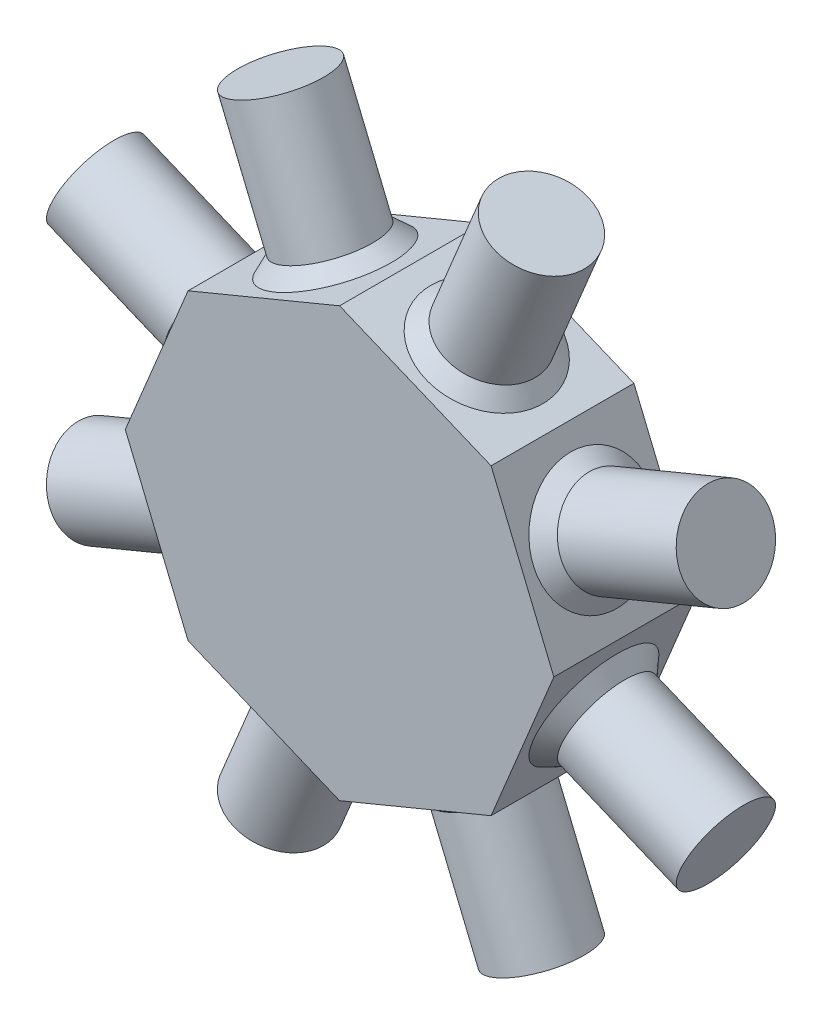
ISO-10303-21;
HEADER;
FILE_DESCRIPTION(('STEP AP214'),'2;1');
FILE_NAME('part.step','',(''),(''),'','','');
FILE_SCHEMA(('AUTOMOTIVE_DESIGN { 1 0 10303 214 1 1 1 1 }'));
ENDSEC;
DATA;
#1=APPLICATION_CONTEXT('core data for automotive mechanical design processes');
#2=APPLICATION_PROTOCOL_DEFINITION('international standard','automotive_design',2000,#1);
#3=PRODUCT_CONTEXT('',#1,'mechanical');
#4=PRODUCT('Part','Part','',(#3));
#5=PRODUCT_RELATED_PRODUCT_CATEGORY('part','',(#4));
#6=PRODUCT_DEFINITION_FORMATION('','',#4);
#7=PRODUCT_DEFINITION_CONTEXT('part definition',#1,'design');
#8=PRODUCT_DEFINITION('design','',#6,#7);
#9=PRODUCT_DEFINITION_SHAPE('','',#8);
#10=(LENGTH_UNIT() NAMED_UNIT(*) SI_UNIT(.MILLI.,.METRE.));
#11=(NAMED_UNIT(*) PLANE_ANGLE_UNIT() SI_UNIT($,.RADIAN.));
#12=(NAMED_UNIT(*) SI_UNIT($,.STERADIAN.) SOLID_ANGLE_UNIT());
#13=UNCERTAINTY_MEASURE_WITH_UNIT(LENGTH_MEASURE(1.E-05),#10,'distance_accuracy_value','');
#14=(GEOMETRIC_REPRESENTATION_CONTEXT(3) GLOBAL_UNCERTAINTY_ASSIGNED_CONTEXT((#13)) GLOBAL_UNIT_ASSIGNED_CONTEXT((#10,
#11,#12)) REPRESENTATION_CONTEXT('',''));
#15=CARTESIAN_POINT('',(0.,0.,0.));
#16=DIRECTION('',(0.,0.,1.));
#17=DIRECTION('',(1.,0.,0.));
#18=AXIS2_PLACEMENT_3D('',#15,#16,#17);
#19=CARTESIAN_POINT('',(0.,38.1,-12.7));
#20=DIRECTION('',(-0.382683432365089,0.923879532511287,0.));
#21=DIRECTION('',(-0.923879532511287,-0.382683432365089,0.));
#22=AXIS2_PLACEMENT_3D('',#19,#20,#21);
#23=PLANE('',#22);
#24=CARTESIAN_POINT('',(-13.4703841816033,32.5203841816039,0.));
#25=DIRECTION('',(-0.382683432365089,0.923879532511287,0.));
#26=DIRECTION('',(-0.923879532511287,-0.382683432365089,0.));
#27=AXIS2_PLACEMENT_3D('',#24,#25,#26);
#28=CIRCLE('',#27,10.795);
#29=CARTESIAN_POINT('',(-23.4436637350626,28.3893165292228,0.));
#30=VERTEX_POINT('',#29);
#31=EDGE_CURVE('E207',#30,#30,#28,.F.);
#32=ORIENTED_EDGE('',*,*,#31,.T.);
#33=EDGE_LOOP('',(#32));
#34=FACE_BOUND('',#33,.T.);
#35=DIRECTION('',(-0.923879532511287,-0.382683432365089,0.));
#36=VECTOR('',#35,1.);
#37=CARTESIAN_POINT('',(0.,38.1,12.7));
#38=LINE('',#37,#36);
#39=CARTESIAN_POINT('',(0.,38.1,12.7));
#40=VERTEX_POINT('',#39);
#41=CARTESIAN_POINT('',(-26.9407683632075,26.9407683632075,12.7));
#42=VERTEX_POINT('',#41);
#43=EDGE_CURVE('E139',#40,#42,#38,.T.);
#44=ORIENTED_EDGE('',*,*,#43,.F.);
#45=DIRECTION('',(0.,0.,1.));
#46=VECTOR('',#45,1.);
#47=CARTESIAN_POINT('',(0.,38.1,-12.7));
#48=LINE('',#47,#46);
#49=CARTESIAN_POINT('',(0.,38.1,-12.7));
#50=VERTEX_POINT('',#49);
#51=EDGE_CURVE('E135',#50,#40,#48,.T.);
#52=ORIENTED_EDGE('',*,*,#51,.F.);
#53=DIRECTION('',(-0.923879532511287,-0.382683432365089,0.));
#54=VECTOR('',#53,1.);
#55=CARTESIAN_POINT('',(0.,38.1,-12.7));
#56=LINE('',#55,#54);
#57=CARTESIAN_POINT('',(-26.9407683632075,26.9407683632075,-12.7));
#58=VERTEX_POINT('',#57);
#59=EDGE_CURVE('E116',#50,#58,#56,.T.);
#60=ORIENTED_EDGE('',*,*,#59,.T.);
#61=DIRECTION('',(0.,0.,1.));
#62=VECTOR('',#61,1.);
#63=CARTESIAN_POINT('',(-26.9407683632075,26.9407683632075,-12.7));
#64=LINE('',#63,#62);
#65=EDGE_CURVE('E108',#58,#42,#64,.T.);
#66=ORIENTED_EDGE('',*,*,#65,.T.);
#67=EDGE_LOOP('',(#44,#52,#60,#66));
#68=FACE_BOUND('',#67,.T.);
#69=ADVANCED_FACE('F34',(#34,#68),#23,.T.);
#70=CARTESIAN_POINT('',(-26.9407683632075,26.9407683632075,-12.7));
#71=DIRECTION('',(-0.923879532511287,0.38268343236509,0.));
#72=DIRECTION('',(-0.38268343236509,-0.923879532511287,0.));
#73=AXIS2_PLACEMENT_3D('',#70,#71,#72);
#74=PLANE('',#73);
#75=CARTESIAN_POINT('',(-32.5203841816036,13.4703841816041,0.));
#76=DIRECTION('',(-0.923879532511287,0.38268343236509,0.));
#77=DIRECTION('',(-0.38268343236509,-0.923879532511287,0.));
#78=AXIS2_PLACEMENT_3D('',#75,#76,#77);
#79=CIRCLE('',#78,10.7950000000001);
#80=CARTESIAN_POINT('',(-36.6514518339848,3.49710462814462,0.));
#81=VERTEX_POINT('',#80);
#82=EDGE_CURVE('E201',#81,#81,#79,.F.);
#83=ORIENTED_EDGE('',*,*,#82,.T.);
#84=EDGE_LOOP('',(#83));
#85=FACE_BOUND('',#84,.T.);
#86=DIRECTION('',(-0.38268343236509,-0.923879532511287,0.));
#87=VECTOR('',#86,1.);
#88=CARTESIAN_POINT('',(-26.9407683632075,26.9407683632075,12.7));
#89=LINE('',#88,#87);
#90=CARTESIAN_POINT('',(-38.1,0.,12.7));
#91=VERTEX_POINT('',#90);
#92=EDGE_CURVE('E49',#42,#91,#89,.T.);
#93=ORIENTED_EDGE('',*,*,#92,.F.);
#94=ORIENTED_EDGE('',*,*,#65,.F.);
#95=DIRECTION('',(-0.38268343236509,-0.923879532511287,0.));
#96=VECTOR('',#95,1.);
#97=CARTESIAN_POINT('',(-26.9407683632075,26.9407683632075,-12.7));
#98=LINE('',#97,#96);
#99=CARTESIAN_POINT('',(-38.1,0.,-12.7));
#100=VERTEX_POINT('',#99);
#101=EDGE_CURVE('E111',#58,#100,#98,.T.);
#102=ORIENTED_EDGE('',*,*,#101,.T.);
#103=DIRECTION('',(0.,0.,1.));
#104=VECTOR('',#103,1.);
#105=CARTESIAN_POINT('',(-38.1,0.,-12.7));
#106=LINE('',#105,#104);
#107=EDGE_CURVE('E99',#100,#91,#106,.T.);
#108=ORIENTED_EDGE('',*,*,#107,.T.);
#109=EDGE_LOOP('',(#93,#94,#102,#108));
#110=FACE_BOUND('',#109,.T.);
#111=ADVANCED_FACE('F112',(#85,#110),#74,.T.);
#112=CARTESIAN_POINT('',(-38.1,0.,-12.7));
#113=DIRECTION('',(-0.923879532511287,-0.382683432365089,0.));
#114=DIRECTION('',(0.38268343236509,-0.923879532511287,0.));
#115=AXIS2_PLACEMENT_3D('',#112,#113,#114);
#116=PLANE('',#115);
#117=CARTESIAN_POINT('',(-32.5203841816039,-13.4703841816034,0.));
#118=DIRECTION('',(-0.923879532511287,-0.382683432365089,0.));
#119=DIRECTION('',(0.38268343236509,-0.923879532511287,0.));
#120=AXIS2_PLACEMENT_3D('',#117,#118,#119);
#121=CIRCLE('',#120,10.7950000000001);
#122=CARTESIAN_POINT('',(-28.3893165292227,-23.4436637350628,0.));
#123=VERTEX_POINT('',#122);
#124=EDGE_CURVE('E195',#123,#123,#121,.F.);
#125=ORIENTED_EDGE('',*,*,#124,.T.);
#126=EDGE_LOOP('',(#125));
#127=FACE_BOUND('',#126,.T.);
#128=DIRECTION('',(0.38268343236509,-0.923879532511287,0.));
#129=VECTOR('',#128,1.);
#130=CARTESIAN_POINT('',(-38.1,0.,12.7));
#131=LINE('',#130,#129);
#132=CARTESIAN_POINT('',(-26.9407683632075,-26.9407683632074,12.7));
#133=VERTEX_POINT('',#132);
#134=EDGE_CURVE('E106',#91,#133,#131,.T.);
#135=ORIENTED_EDGE('',*,*,#134,.F.);
#136=ORIENTED_EDGE('',*,*,#107,.F.);
#137=DIRECTION('',(0.38268343236509,-0.923879532511287,0.));
#138=VECTOR('',#137,1.);
#139=CARTESIAN_POINT('',(-38.1,0.,-12.7));
#140=LINE('',#139,#138);
#141=CARTESIAN_POINT('',(-26.9407683632075,-26.9407683632074,-12.7));
#142=VERTEX_POINT('',#141);
#143=EDGE_CURVE('E103',#100,#142,#140,.T.);
#144=ORIENTED_EDGE('',*,*,#143,.T.);
#145=DIRECTION('',(0.,0.,1.));
#146=VECTOR('',#145,1.);
#147=CARTESIAN_POINT('',(-26.9407683632075,-26.9407683632074,-12.7));
#148=LINE('',#147,#146);
#149=EDGE_CURVE('E107',#142,#133,#148,.T.);
#150=ORIENTED_EDGE('',*,*,#149,.T.);
#151=EDGE_LOOP('',(#135,#136,#144,#150));
#152=FACE_BOUND('',#151,.T.);
#153=ADVANCED_FACE('F101',(#127,#152),#116,.T.);
#154=CARTESIAN_POINT('',(-26.9407683632075,-26.9407683632074,-12.7));
#155=DIRECTION('',(-0.38268343236509,-0.923879532511287,0.));
#156=DIRECTION('',(0.923879532511287,-0.38268343236509,0.));
#157=AXIS2_PLACEMENT_3D('',#154,#155,#156);
#158=PLANE('',#157);
#159=CARTESIAN_POINT('',(-13.4703841816037,-32.5203841816037,0.));
#160=DIRECTION('',(-0.38268343236509,-0.923879532511287,0.));
#161=DIRECTION('',(0.923879532511287,-0.38268343236509,0.));
#162=AXIS2_PLACEMENT_3D('',#159,#160,#161);
#163=CIRCLE('',#162,10.7950000000001);
#164=CARTESIAN_POINT('',(-3.49710462814426,-36.6514518339849,0.));
#165=VERTEX_POINT('',#164);
#166=EDGE_CURVE('E189',#165,#165,#163,.F.);
#167=ORIENTED_EDGE('',*,*,#166,.T.);
#168=EDGE_LOOP('',(#167));
#169=FACE_BOUND('',#168,.T.);
#170=DIRECTION('',(0.923879532511287,-0.38268343236509,0.));
#171=VECTOR('',#170,1.);
#172=CARTESIAN_POINT('',(-26.9407683632075,-26.9407683632074,12.7));
#173=LINE('',#172,#171);
#174=CARTESIAN_POINT('',(0.,-38.1,12.7));
#175=VERTEX_POINT('',#174);
#176=EDGE_CURVE('E145',#133,#175,#173,.T.);
#177=ORIENTED_EDGE('',*,*,#176,.F.);
#178=ORIENTED_EDGE('',*,*,#149,.F.);
#179=DIRECTION('',(0.923879532511287,-0.38268343236509,0.));
#180=VECTOR('',#179,1.);
#181=CARTESIAN_POINT('',(-26.9407683632075,-26.9407683632074,-12.7));
#182=LINE('',#181,#180);
#183=CARTESIAN_POINT('',(0.,-38.1,-12.7));
#184=VERTEX_POINT('',#183);
#185=EDGE_CURVE('E121',#142,#184,#182,.T.);
#186=ORIENTED_EDGE('',*,*,#185,.T.);
#187=DIRECTION('',(0.,0.,1.));
#188=VECTOR('',#187,1.);
#189=CARTESIAN_POINT('',(0.,-38.1,-12.7));
#190=LINE('',#189,#188);
#191=EDGE_CURVE('E164',#184,#175,#190,.T.);
#192=ORIENTED_EDGE('',*,*,#191,.T.);
#193=EDGE_LOOP('',(#177,#178,#186,#192));
#194=FACE_BOUND('',#193,.T.);
#195=ADVANCED_FACE('F321',(#169,#194),#158,.T.);
#196=CARTESIAN_POINT('',(0.,-38.1,-12.7));
#197=DIRECTION('',(0.38268343236509,-0.923879532511287,0.));
#198=DIRECTION('',(0.923879532511287,0.38268343236509,0.));
#199=AXIS2_PLACEMENT_3D('',#196,#197,#198);
#200=PLANE('',#199);
#201=CARTESIAN_POINT('',(13.4703841816035,-32.5203841816038,0.));
#202=DIRECTION('',(0.38268343236509,-0.923879532511287,0.));
#203=DIRECTION('',(0.923879532511287,0.38268343236509,0.));
#204=AXIS2_PLACEMENT_3D('',#201,#202,#203);
#205=CIRCLE('',#204,10.795);
#206=CARTESIAN_POINT('',(23.4436637350629,-28.3893165292227,0.));
#207=VERTEX_POINT('',#206);
#208=EDGE_CURVE('E183',#207,#207,#205,.F.);
#209=ORIENTED_EDGE('',*,*,#208,.T.);
#210=EDGE_LOOP('',(#209));
#211=FACE_BOUND('',#210,.T.);
#212=DIRECTION('',(0.923879532511287,0.38268343236509,0.));
#213=VECTOR('',#212,1.);
#214=CARTESIAN_POINT('',(0.,-38.1,12.7));
#215=LINE('',#214,#213);
#216=CARTESIAN_POINT('',(26.9407683632075,-26.9407683632075,12.7));
#217=VERTEX_POINT('',#216);
#218=EDGE_CURVE('E148',#175,#217,#215,.T.);
#219=ORIENTED_EDGE('',*,*,#218,.F.);
#220=ORIENTED_EDGE('',*,*,#191,.F.);
#221=DIRECTION('',(0.923879532511287,0.38268343236509,0.));
#222=VECTOR('',#221,1.);
#223=CARTESIAN_POINT('',(0.,-38.1,-12.7));
#224=LINE('',#223,#222);
#225=CARTESIAN_POINT('',(26.9407683632075,-26.9407683632075,-12.7));
#226=VERTEX_POINT('',#225);
#227=EDGE_CURVE('E123',#184,#226,#224,.T.);
#228=ORIENTED_EDGE('',*,*,#227,.T.);
#229=DIRECTION('',(0.,0.,1.));
#230=VECTOR('',#229,1.);
#231=CARTESIAN_POINT('',(26.9407683632075,-26.9407683632075,-12.7));
#232=LINE('',#231,#230);
#233=EDGE_CURVE('E162',#226,#217,#232,.T.);
#234=ORIENTED_EDGE('',*,*,#233,.T.);
#235=EDGE_LOOP('',(#219,#220,#228,#234));
#236=FACE_BOUND('',#235,.T.);
#237=ADVANCED_FACE('F318',(#211,#236),#200,.T.);
#238=CARTESIAN_POINT('',(26.9407683632075,-26.9407683632075,-12.7));
#239=DIRECTION('',(0.923879532511287,-0.38268343236509,0.));
#240=DIRECTION('',(0.38268343236509,0.923879532511287,0.));
#241=AXIS2_PLACEMENT_3D('',#238,#239,#240);
#242=PLANE('',#241);
#243=CARTESIAN_POINT('',(32.5203841816037,-13.4703841816038,0.));
#244=DIRECTION('',(0.923879532511287,-0.38268343236509,0.));
#245=DIRECTION('',(0.38268343236509,0.923879532511287,0.));
#246=AXIS2_PLACEMENT_3D('',#243,#244,#245);
#247=CIRCLE('',#246,10.7950000000001);
#248=CARTESIAN_POINT('',(36.6514518339849,-3.49710462814443,0.));
#249=VERTEX_POINT('',#248);
#250=EDGE_CURVE('E177',#249,#249,#247,.F.);
#251=ORIENTED_EDGE('',*,*,#250,.T.);
#252=EDGE_LOOP('',(#251));
#253=FACE_BOUND('',#252,.T.);
#254=DIRECTION('',(0.38268343236509,0.923879532511287,0.));
#255=VECTOR('',#254,1.);
#256=CARTESIAN_POINT('',(26.9407683632075,-26.9407683632075,12.7));
#257=LINE('',#256,#255);
#258=CARTESIAN_POINT('',(38.1,0.,12.7));
#259=VERTEX_POINT('',#258);
#260=EDGE_CURVE('E151',#217,#259,#257,.T.);
#261=ORIENTED_EDGE('',*,*,#260,.F.);
#262=ORIENTED_EDGE('',*,*,#233,.F.);
#263=DIRECTION('',(0.38268343236509,0.923879532511287,0.));
#264=VECTOR('',#263,1.);
#265=CARTESIAN_POINT('',(26.9407683632075,-26.9407683632075,-12.7));
#266=LINE('',#265,#264);
#267=CARTESIAN_POINT('',(38.1,0.,-12.7));
#268=VERTEX_POINT('',#267);
#269=EDGE_CURVE('E129',#226,#268,#266,.T.);
#270=ORIENTED_EDGE('',*,*,#269,.T.);
#271=DIRECTION('',(0.,0.,1.));
#272=VECTOR('',#271,1.);
#273=CARTESIAN_POINT('',(38.1,0.,-12.7));
#274=LINE('',#273,#272);
#275=EDGE_CURVE('E160',#268,#259,#274,.T.);
#276=ORIENTED_EDGE('',*,*,#275,.T.);
#277=EDGE_LOOP('',(#261,#262,#270,#276));
#278=FACE_BOUND('',#277,.T.);
#279=ADVANCED_FACE('F315',(#253,#278),#242,.T.);
#280=CARTESIAN_POINT('',(38.1,0.,-12.7));
#281=DIRECTION('',(0.923879532511287,0.382683432365089,0.));
#282=DIRECTION('',(-0.38268343236509,0.923879532511287,0.));
#283=AXIS2_PLACEMENT_3D('',#280,#281,#282);
#284=PLANE('',#283);
#285=CARTESIAN_POINT('',(32.5203841816038,13.4703841816037,0.));
#286=DIRECTION('',(0.923879532511287,0.382683432365089,0.));
#287=DIRECTION('',(-0.38268343236509,0.923879532511287,0.));
#288=AXIS2_PLACEMENT_3D('',#285,#286,#287);
#289=CIRCLE('',#288,10.795);
#290=CARTESIAN_POINT('',(28.3893165292226,23.443663735063,0.));
#291=VERTEX_POINT('',#290);
#292=EDGE_CURVE('E171',#291,#291,#289,.F.);
#293=ORIENTED_EDGE('',*,*,#292,.T.);
#294=EDGE_LOOP('',(#293));
#295=FACE_BOUND('',#294,.T.);
#296=DIRECTION('',(-0.38268343236509,0.923879532511287,0.));
#297=VECTOR('',#296,1.);
#298=CARTESIAN_POINT('',(38.1,0.,12.7));
#299=LINE('',#298,#297);
#300=CARTESIAN_POINT('',(26.9407683632075,26.9407683632074,12.7));
#301=VERTEX_POINT('',#300);
#302=EDGE_CURVE('E154',#259,#301,#299,.T.);
#303=ORIENTED_EDGE('',*,*,#302,.F.);
#304=ORIENTED_EDGE('',*,*,#275,.F.);
#305=DIRECTION('',(-0.38268343236509,0.923879532511287,0.));
#306=VECTOR('',#305,1.);
#307=CARTESIAN_POINT('',(38.1,0.,-12.7));
#308=LINE('',#307,#306);
#309=CARTESIAN_POINT('',(26.9407683632075,26.9407683632074,-12.7));
#310=VERTEX_POINT('',#309);
#311=EDGE_CURVE('E132',#268,#310,#308,.T.);
#312=ORIENTED_EDGE('',*,*,#311,.T.);
#313=DIRECTION('',(0.,0.,1.));
#314=VECTOR('',#313,1.);
#315=CARTESIAN_POINT('',(26.9407683632075,26.9407683632074,-12.7));
#316=LINE('',#315,#314);
#317=EDGE_CURVE('E157',#310,#301,#316,.T.);
#318=ORIENTED_EDGE('',*,*,#317,.T.);
#319=EDGE_LOOP('',(#303,#304,#312,#318));
#320=FACE_BOUND('',#319,.T.);
#321=ADVANCED_FACE('F238',(#295,#320),#284,.T.);
#322=CARTESIAN_POINT('',(26.9407683632075,26.9407683632074,-12.7));
#323=DIRECTION('',(0.38268343236509,0.923879532511287,0.));
#324=DIRECTION('',(-0.923879532511287,0.38268343236509,0.));
#325=AXIS2_PLACEMENT_3D('',#322,#323,#324);
#326=PLANE('',#325);
#327=CARTESIAN_POINT('',(13.4703841816037,32.5203841816037,0.));
#328=DIRECTION('',(0.38268343236509,0.923879532511287,0.));
#329=DIRECTION('',(-0.923879532511287,0.38268343236509,0.));
#330=AXIS2_PLACEMENT_3D('',#327,#328,#329);
#331=CIRCLE('',#330,10.7950000000001);
#332=CARTESIAN_POINT('',(3.49710462814428,36.6514518339849,0.));
#333=VERTEX_POINT('',#332);
#334=EDGE_CURVE('E12',#333,#333,#331,.F.);
#335=ORIENTED_EDGE('',*,*,#334,.T.);
#336=EDGE_LOOP('',(#335));
#337=FACE_BOUND('',#336,.T.);
#338=DIRECTION('',(-0.923879532511287,0.38268343236509,0.));
#339=VECTOR('',#338,1.);
#340=CARTESIAN_POINT('',(26.9407683632075,26.9407683632074,12.7));
#341=LINE('',#340,#339);
#342=EDGE_CURVE('E136',#301,#40,#341,.T.);
#343=ORIENTED_EDGE('',*,*,#342,.F.);
#344=ORIENTED_EDGE('',*,*,#317,.F.);
#345=DIRECTION('',(-0.923879532511287,0.38268343236509,0.));
#346=VECTOR('',#345,1.);
#347=CARTESIAN_POINT('',(26.9407683632075,26.9407683632074,-12.7));
#348=LINE('',#347,#346);
#349=EDGE_CURVE('E57',#310,#50,#348,.T.);
#350=ORIENTED_EDGE('',*,*,#349,.T.);
#351=ORIENTED_EDGE('',*,*,#51,.T.);
#352=EDGE_LOOP('',(#343,#344,#350,#351));
#353=FACE_BOUND('',#352,.T.);
#354=ADVANCED_FACE('F235',(#337,#353),#326,.T.);
#355=CARTESIAN_POINT('',(0.,0.,-12.7));
#356=DIRECTION('',(0.,0.,1.));
#357=DIRECTION('',(1.,0.,0.));
#358=AXIS2_PLACEMENT_3D('',#355,#356,#357);
#359=PLANE('',#358);
#360=ORIENTED_EDGE('',*,*,#349,.F.);
#361=ORIENTED_EDGE('',*,*,#311,.F.);
#362=ORIENTED_EDGE('',*,*,#269,.F.);
#363=ORIENTED_EDGE('',*,*,#227,.F.);
#364=ORIENTED_EDGE('',*,*,#185,.F.);
#365=ORIENTED_EDGE('',*,*,#143,.F.);
#366=ORIENTED_EDGE('',*,*,#101,.F.);
#367=ORIENTED_EDGE('',*,*,#59,.F.);
#368=EDGE_LOOP('',(#360,#361,#362,#363,#364,#365,#366,#367));
#369=FACE_BOUND('',#368,.T.);
#370=ADVANCED_FACE('F118',(#369),#359,.F.);
#371=CARTESIAN_POINT('',(0.,0.,12.7));
#372=DIRECTION('',(0.,0.,1.));
#373=DIRECTION('',(1.,0.,0.));
#374=AXIS2_PLACEMENT_3D('',#371,#372,#373);
#375=PLANE('',#374);
#376=ORIENTED_EDGE('',*,*,#302,.T.);
#377=ORIENTED_EDGE('',*,*,#342,.T.);
#378=ORIENTED_EDGE('',*,*,#43,.T.);
#379=ORIENTED_EDGE('',*,*,#92,.T.);
#380=ORIENTED_EDGE('',*,*,#134,.T.);
#381=ORIENTED_EDGE('',*,*,#176,.T.);
#382=ORIENTED_EDGE('',*,*,#218,.T.);
#383=ORIENTED_EDGE('',*,*,#260,.T.);
#384=EDGE_LOOP('',(#376,#377,#378,#379,#380,#381,#382,#383));
#385=FACE_BOUND('',#384,.T.);
#386=ADVANCED_FACE('F240',(#385),#375,.T.);
#387=CARTESIAN_POINT('',(23.190543363677,55.9869243073904,0.));
#388=DIRECTION('',(-0.38268343236509,-0.923879532511287,0.));
#389=DIRECTION('',(0.923879532511287,-0.38268343236509,0.));
#390=AXIS2_PLACEMENT_3D('',#387,#388,#389);
#391=CYLINDRICAL_SURFACE('',#390,8.255);
#392=CARTESIAN_POINT('',(14.4424000998111,34.8670381941825,0.));
#393=DIRECTION('',(0.38268343236509,0.923879532511287,0.));
#394=DIRECTION('',(-0.923879532511287,0.38268343236509,0.));
#395=AXIS2_PLACEMENT_3D('',#392,#393,#394);
#396=CIRCLE('',#395,8.255);
#397=CARTESIAN_POINT('',(6.81577455893044,38.0260899283563,0.));
#398=VERTEX_POINT('',#397);
#399=EDGE_CURVE('E42',#398,#398,#396,.T.);
#400=ORIENTED_EDGE('',*,*,#399,.T.);
#401=EDGE_LOOP('',(#400));
#402=FACE_BOUND('',#401,.T.);
#403=CARTESIAN_POINT('',(23.190543363677,55.9869243073904,0.));
#404=DIRECTION('',(0.38268343236509,0.923879532511287,0.));
#405=DIRECTION('',(-0.923879532511287,0.38268343236509,0.));
#406=AXIS2_PLACEMENT_3D('',#403,#404,#405);
#407=CIRCLE('',#406,8.255);
#408=CARTESIAN_POINT('',(15.5639178227964,59.1459760415642,0.));
#409=VERTEX_POINT('',#408);
#410=EDGE_CURVE('E140',#409,#409,#407,.T.);
#411=ORIENTED_EDGE('',*,*,#410,.F.);
#412=EDGE_LOOP('',(#411));
#413=FACE_BOUND('',#412,.T.);
#414=ADVANCED_FACE('F212',(#402,#413),#391,.T.);
#415=CARTESIAN_POINT('',(23.190543363677,55.9869243073904,0.));
#416=DIRECTION('',(0.38268343236509,0.923879532511287,0.));
#417=DIRECTION('',(-0.923879532511287,0.38268343236509,0.));
#418=AXIS2_PLACEMENT_3D('',#415,#416,#417);
#419=PLANE('',#418);
#420=ORIENTED_EDGE('',*,*,#410,.T.);
#421=EDGE_LOOP('',(#420));
#422=FACE_BOUND('',#421,.T.);
#423=ADVANCED_FACE('F341',(#422),#419,.T.);
#424=CARTESIAN_POINT('',(55.9869243073905,23.1905433636769,0.));
#425=DIRECTION('',(-0.923879532511288,-0.382683432365088,0.));
#426=DIRECTION('',(0.382683432365088,-0.923879532511288,0.));
#427=AXIS2_PLACEMENT_3D('',#424,#425,#426);
#428=CYLINDRICAL_SURFACE('',#427,8.255);
#429=CARTESIAN_POINT('',(34.8670381941824,14.442400099811,0.));
#430=DIRECTION('',(0.923879532511288,0.382683432365088,0.));
#431=DIRECTION('',(-0.382683432365088,0.923879532511288,0.));
#432=AXIS2_PLACEMENT_3D('',#429,#430,#431);
#433=CIRCLE('',#432,8.255);
#434=CARTESIAN_POINT('',(31.7079864600086,22.0690256406917,0.));
#435=VERTEX_POINT('',#434);
#436=EDGE_CURVE('E159',#435,#435,#433,.T.);
#437=ORIENTED_EDGE('',*,*,#436,.T.);
#438=EDGE_LOOP('',(#437));
#439=FACE_BOUND('',#438,.T.);
#440=CARTESIAN_POINT('',(55.9869243073905,23.1905433636769,0.));
#441=DIRECTION('',(0.923879532511288,0.382683432365088,0.));
#442=DIRECTION('',(-0.382683432365088,0.923879532511288,0.));
#443=AXIS2_PLACEMENT_3D('',#440,#441,#442);
#444=CIRCLE('',#443,8.255);
#445=CARTESIAN_POINT('',(52.8278725732167,30.8171689045576,0.));
#446=VERTEX_POINT('',#445);
#447=EDGE_CURVE('E302',#446,#446,#444,.T.);
#448=ORIENTED_EDGE('',*,*,#447,.F.);
#449=EDGE_LOOP('',(#448));
#450=FACE_BOUND('',#449,.T.);
#451=ADVANCED_FACE('F344',(#439,#450),#428,.T.);
#452=CARTESIAN_POINT('',(55.9869243073905,23.1905433636769,0.));
#453=DIRECTION('',(0.923879532511288,0.382683432365088,0.));
#454=DIRECTION('',(-0.382683432365088,0.923879532511288,0.));
#455=AXIS2_PLACEMENT_3D('',#452,#453,#454);
#456=PLANE('',#455);
#457=ORIENTED_EDGE('',*,*,#447,.T.);
#458=EDGE_LOOP('',(#457));
#459=FACE_BOUND('',#458,.T.);
#460=ADVANCED_FACE('F348',(#459),#456,.T.);
#461=CARTESIAN_POINT('',(55.9869243073903,-23.1905433636772,0.));
#462=DIRECTION('',(-0.923879532511285,0.382683432365093,0.));
#463=DIRECTION('',(-0.382683432365093,-0.923879532511285,0.));
#464=AXIS2_PLACEMENT_3D('',#461,#462,#463);
#465=CYLINDRICAL_SURFACE('',#464,8.255);
#466=CARTESIAN_POINT('',(34.8670381941824,-14.4424000998112,0.));
#467=DIRECTION('',(0.923879532511285,-0.382683432365093,0.));
#468=DIRECTION('',(0.382683432365093,0.923879532511286,0.));
#469=AXIS2_PLACEMENT_3D('',#466,#467,#468);
#470=CIRCLE('',#469,8.255);
#471=CARTESIAN_POINT('',(38.0260899283562,-6.81577455893054,0.));
#472=VERTEX_POINT('',#471);
#473=EDGE_CURVE('E174',#472,#472,#470,.T.);
#474=ORIENTED_EDGE('',*,*,#473,.T.);
#475=EDGE_LOOP('',(#474));
#476=FACE_BOUND('',#475,.T.);
#477=CARTESIAN_POINT('',(55.9869243073903,-23.1905433636772,0.));
#478=DIRECTION('',(0.923879532511285,-0.382683432365093,0.));
#479=DIRECTION('',(0.382683432365093,0.923879532511285,0.));
#480=AXIS2_PLACEMENT_3D('',#477,#478,#479);
#481=CIRCLE('',#480,8.255);
#482=CARTESIAN_POINT('',(59.1459760415642,-15.5639178227966,0.));
#483=VERTEX_POINT('',#482);
#484=EDGE_CURVE('E299',#483,#483,#481,.T.);
#485=ORIENTED_EDGE('',*,*,#484,.F.);
#486=EDGE_LOOP('',(#485));
#487=FACE_BOUND('',#486,.T.);
#488=ADVANCED_FACE('F352',(#476,#487),#465,.T.);
#489=CARTESIAN_POINT('',(55.9869243073903,-23.1905433636772,0.));
#490=DIRECTION('',(0.923879532511285,-0.382683432365093,0.));
#491=DIRECTION('',(0.382683432365093,0.923879532511285,0.));
#492=AXIS2_PLACEMENT_3D('',#489,#490,#491);
#493=PLANE('',#492);
#494=ORIENTED_EDGE('',*,*,#484,.T.);
#495=EDGE_LOOP('',(#494));
#496=FACE_BOUND('',#495,.T.);
#497=ADVANCED_FACE('F356',(#496),#493,.T.);
#498=CARTESIAN_POINT('',(23.1905433636767,-55.9869243073906,0.));
#499=DIRECTION('',(-0.382683432365085,0.923879532511289,0.));
#500=DIRECTION('',(-0.923879532511289,-0.382683432365085,0.));
#501=AXIS2_PLACEMENT_3D('',#498,#499,#500);
#502=CYLINDRICAL_SURFACE('',#501,8.255);
#503=CARTESIAN_POINT('',(14.4424000998108,-34.8670381941824,0.));
#504=DIRECTION('',(0.382683432365084,-0.923879532511289,0.));
#505=DIRECTION('',(0.923879532511289,0.382683432365084,0.));
#506=AXIS2_PLACEMENT_3D('',#503,#504,#505);
#507=CIRCLE('',#506,8.255);
#508=CARTESIAN_POINT('',(22.0690256406915,-31.7079864600086,0.));
#509=VERTEX_POINT('',#508);
#510=EDGE_CURVE('E180',#509,#509,#507,.T.);
#511=ORIENTED_EDGE('',*,*,#510,.T.);
#512=EDGE_LOOP('',(#511));
#513=FACE_BOUND('',#512,.T.);
#514=CARTESIAN_POINT('',(23.1905433636767,-55.9869243073906,0.));
#515=DIRECTION('',(0.382683432365085,-0.923879532511289,0.));
#516=DIRECTION('',(0.923879532511289,0.382683432365085,0.));
#517=AXIS2_PLACEMENT_3D('',#514,#515,#516);
#518=CIRCLE('',#517,8.255);
#519=CARTESIAN_POINT('',(30.8171689045574,-52.8278725732168,0.));
#520=VERTEX_POINT('',#519);
#521=EDGE_CURVE('E296',#520,#520,#518,.T.);
#522=ORIENTED_EDGE('',*,*,#521,.F.);
#523=EDGE_LOOP('',(#522));
#524=FACE_BOUND('',#523,.T.);
#525=ADVANCED_FACE('F360',(#513,#524),#502,.T.);
#526=CARTESIAN_POINT('',(23.1905433636767,-55.9869243073906,0.));
#527=DIRECTION('',(0.382683432365085,-0.923879532511289,0.));
#528=DIRECTION('',(0.923879532511289,0.382683432365085,0.));
#529=AXIS2_PLACEMENT_3D('',#526,#527,#528);
#530=PLANE('',#529);
#531=ORIENTED_EDGE('',*,*,#521,.T.);
#532=EDGE_LOOP('',(#531));
#533=FACE_BOUND('',#532,.T.);
#534=ADVANCED_FACE('F364',(#533),#530,.T.);
#535=CARTESIAN_POINT('',(-23.190543363677,-55.9869243073904,0.));
#536=DIRECTION('',(0.38268343236509,0.923879532511287,0.));
#537=DIRECTION('',(-0.923879532511287,0.38268343236509,0.));
#538=AXIS2_PLACEMENT_3D('',#535,#536,#537);
#539=CYLINDRICAL_SURFACE('',#538,8.255);
#540=CARTESIAN_POINT('',(-14.4424000998111,-34.8670381941825,0.));
#541=DIRECTION('',(-0.382683432365091,-0.923879532511286,0.));
#542=DIRECTION('',(0.923879532511286,-0.382683432365091,0.));
#543=AXIS2_PLACEMENT_3D('',#540,#541,#542);
#544=CIRCLE('',#543,8.255);
#545=CARTESIAN_POINT('',(-6.81577455893045,-38.0260899283563,0.));
#546=VERTEX_POINT('',#545);
#547=EDGE_CURVE('E186',#546,#546,#544,.T.);
#548=ORIENTED_EDGE('',*,*,#547,.T.);
#549=EDGE_LOOP('',(#548));
#550=FACE_BOUND('',#549,.T.);
#551=CARTESIAN_POINT('',(-23.190543363677,-55.9869243073904,0.));
#552=DIRECTION('',(-0.38268343236509,-0.923879532511287,0.));
#553=DIRECTION('',(0.923879532511287,-0.38268343236509,0.));
#554=AXIS2_PLACEMENT_3D('',#551,#552,#553);
#555=CIRCLE('',#554,8.255);
#556=CARTESIAN_POINT('',(-15.5639178227964,-59.1459760415642,0.));
#557=VERTEX_POINT('',#556);
#558=EDGE_CURVE('E289',#557,#557,#555,.T.);
#559=ORIENTED_EDGE('',*,*,#558,.F.);
#560=EDGE_LOOP('',(#559));
#561=FACE_BOUND('',#560,.T.);
#562=ADVANCED_FACE('F368',(#550,#561),#539,.T.);
#563=CARTESIAN_POINT('',(-23.190543363677,-55.9869243073904,0.));
#564=DIRECTION('',(-0.38268343236509,-0.923879532511287,0.));
#565=DIRECTION('',(0.923879532511287,-0.38268343236509,0.));
#566=AXIS2_PLACEMENT_3D('',#563,#564,#565);
#567=PLANE('',#566);
#568=ORIENTED_EDGE('',*,*,#558,.T.);
#569=EDGE_LOOP('',(#568));
#570=FACE_BOUND('',#569,.T.);
#571=ADVANCED_FACE('F372',(#570),#567,.T.);
#572=CARTESIAN_POINT('',(-55.9869243073906,-23.1905433636765,0.));
#573=DIRECTION('',(0.92387953251129,0.382683432365081,0.));
#574=DIRECTION('',(-0.382683432365081,0.92387953251129,0.));
#575=AXIS2_PLACEMENT_3D('',#572,#573,#574);
#576=CYLINDRICAL_SURFACE('',#575,8.255);
#577=CARTESIAN_POINT('',(-34.8670381941825,-14.4424000998107,0.));
#578=DIRECTION('',(-0.92387953251129,-0.382683432365082,0.));
#579=DIRECTION('',(0.382683432365082,-0.92387953251129,0.));
#580=AXIS2_PLACEMENT_3D('',#577,#578,#579);
#581=CIRCLE('',#580,8.255);
#582=CARTESIAN_POINT('',(-31.7079864600088,-22.0690256406914,0.));
#583=VERTEX_POINT('',#582);
#584=EDGE_CURVE('E192',#583,#583,#581,.T.);
#585=ORIENTED_EDGE('',*,*,#584,.T.);
#586=EDGE_LOOP('',(#585));
#587=FACE_BOUND('',#586,.T.);
#588=CARTESIAN_POINT('',(-55.9869243073906,-23.1905433636765,0.));
#589=DIRECTION('',(-0.92387953251129,-0.382683432365081,0.));
#590=DIRECTION('',(0.382683432365081,-0.92387953251129,0.));
#591=AXIS2_PLACEMENT_3D('',#588,#589,#590);
#592=CIRCLE('',#591,8.255);
#593=CARTESIAN_POINT('',(-52.8278725732169,-30.8171689045572,0.));
#594=VERTEX_POINT('',#593);
#595=EDGE_CURVE('E285',#594,#594,#592,.T.);
#596=ORIENTED_EDGE('',*,*,#595,.F.);
#597=EDGE_LOOP('',(#596));
#598=FACE_BOUND('',#597,.T.);
#599=ADVANCED_FACE('F376',(#587,#598),#576,.T.);
#600=CARTESIAN_POINT('',(-55.9869243073906,-23.1905433636765,0.));
#601=DIRECTION('',(-0.92387953251129,-0.382683432365081,0.));
#602=DIRECTION('',(0.382683432365081,-0.92387953251129,0.));
#603=AXIS2_PLACEMENT_3D('',#600,#601,#602);
#604=PLANE('',#603);
#605=ORIENTED_EDGE('',*,*,#595,.T.);
#606=EDGE_LOOP('',(#605));
#607=FACE_BOUND('',#606,.T.);
#608=ADVANCED_FACE('F279',(#607),#604,.T.);
#609=CARTESIAN_POINT('',(-55.9869243073902,23.1905433636776,0.));
#610=DIRECTION('',(0.923879532511283,-0.3826834323651,0.));
#611=DIRECTION('',(0.3826834323651,0.923879532511283,0.));
#612=AXIS2_PLACEMENT_3D('',#609,#610,#611);
#613=CYLINDRICAL_SURFACE('',#612,8.255);
#614=CARTESIAN_POINT('',(-34.8670381941823,14.4424000998114,0.));
#615=DIRECTION('',(-0.923879532511283,0.3826834323651,0.));
#616=DIRECTION('',(-0.3826834323651,-0.923879532511283,0.));
#617=AXIS2_PLACEMENT_3D('',#614,#615,#616);
#618=CIRCLE('',#617,8.255);
#619=CARTESIAN_POINT('',(-38.0260899283562,6.8157745589308,0.));
#620=VERTEX_POINT('',#619);
#621=EDGE_CURVE('E198',#620,#620,#618,.T.);
#622=ORIENTED_EDGE('',*,*,#621,.T.);
#623=EDGE_LOOP('',(#622));
#624=FACE_BOUND('',#623,.T.);
#625=CARTESIAN_POINT('',(-55.9869243073902,23.1905433636776,0.));
#626=DIRECTION('',(-0.923879532511283,0.3826834323651,0.));
#627=DIRECTION('',(-0.3826834323651,-0.923879532511283,0.));
#628=AXIS2_PLACEMENT_3D('',#625,#626,#627);
#629=CIRCLE('',#628,8.255);
#630=CARTESIAN_POINT('',(-59.1459760415641,15.563917822797,0.));
#631=VERTEX_POINT('',#630);
#632=EDGE_CURVE('E283',#631,#631,#629,.T.);
#633=ORIENTED_EDGE('',*,*,#632,.F.);
#634=EDGE_LOOP('',(#633));
#635=FACE_BOUND('',#634,.T.);
#636=ADVANCED_FACE('F275',(#624,#635),#613,.T.);
#637=CARTESIAN_POINT('',(-55.9869243073902,23.1905433636776,0.));
#638=DIRECTION('',(-0.923879532511283,0.3826834323651,0.));
#639=DIRECTION('',(-0.3826834323651,-0.923879532511283,0.));
#640=AXIS2_PLACEMENT_3D('',#637,#638,#639);
#641=PLANE('',#640);
#642=ORIENTED_EDGE('',*,*,#632,.T.);
#643=EDGE_LOOP('',(#642));
#644=FACE_BOUND('',#643,.T.);
#645=ADVANCED_FACE('F278',(#644),#641,.T.);
#646=CARTESIAN_POINT('',(-23.1905433636763,55.9869243073907,0.));
#647=DIRECTION('',(0.382683432365078,-0.923879532511292,0.));
#648=DIRECTION('',(0.923879532511292,0.382683432365078,0.));
#649=AXIS2_PLACEMENT_3D('',#646,#647,#648);
#650=CYLINDRICAL_SURFACE('',#649,8.255);
#651=CARTESIAN_POINT('',(-14.4424000998106,34.8670381941824,0.));
#652=DIRECTION('',(-0.382683432365078,0.923879532511292,0.));
#653=DIRECTION('',(-0.923879532511292,-0.382683432365078,0.));
#654=AXIS2_PLACEMENT_3D('',#651,#652,#653);
#655=CIRCLE('',#654,8.255);
#656=CARTESIAN_POINT('',(-22.0690256406913,31.7079864600087,0.));
#657=VERTEX_POINT('',#656);
#658=EDGE_CURVE('E204',#657,#657,#655,.T.);
#659=ORIENTED_EDGE('',*,*,#658,.T.);
#660=EDGE_LOOP('',(#659));
#661=FACE_BOUND('',#660,.T.);
#662=CARTESIAN_POINT('',(-23.1905433636763,55.9869243073907,0.));
#663=DIRECTION('',(-0.382683432365078,0.923879532511292,0.));
#664=DIRECTION('',(-0.923879532511292,-0.382683432365078,0.));
#665=AXIS2_PLACEMENT_3D('',#662,#663,#664);
#666=CIRCLE('',#665,8.255);
#667=CARTESIAN_POINT('',(-30.817168904557,52.827872573217,0.));
#668=VERTEX_POINT('',#667);
#669=EDGE_CURVE('E286',#668,#668,#666,.T.);
#670=ORIENTED_EDGE('',*,*,#669,.F.);
#671=EDGE_LOOP('',(#670));
#672=FACE_BOUND('',#671,.T.);
#673=ADVANCED_FACE('F386',(#661,#672),#650,.T.);
#674=CARTESIAN_POINT('',(-23.1905433636763,55.9869243073907,0.));
#675=DIRECTION('',(-0.382683432365078,0.923879532511292,0.));
#676=DIRECTION('',(-0.923879532511292,-0.382683432365078,0.));
#677=AXIS2_PLACEMENT_3D('',#674,#675,#676);
#678=PLANE('',#677);
#679=ORIENTED_EDGE('',*,*,#669,.T.);
#680=EDGE_LOOP('',(#679));
#681=FACE_BOUND('',#680,.T.);
#682=ADVANCED_FACE('F250',(#681),#678,.T.);
#683=CARTESIAN_POINT('',(34.8670381941824,14.442400099811,0.));
#684=DIRECTION('',(-0.923879532511288,-0.382683432365088,0.));
#685=DIRECTION('',(0.382683432365088,-0.923879532511288,0.));
#686=AXIS2_PLACEMENT_3D('',#683,#684,#685);
#687=CONICAL_SURFACE('',#686,8.255,0.785398163397444);
#688=ORIENTED_EDGE('',*,*,#292,.F.);
#689=EDGE_LOOP('',(#688));
#690=FACE_BOUND('',#689,.T.);
#691=ORIENTED_EDGE('',*,*,#436,.F.);
#692=EDGE_LOOP('',(#691));
#693=FACE_BOUND('',#692,.T.);
#694=ADVANCED_FACE('F246',(#690,#693),#687,.T.);
#695=CARTESIAN_POINT('',(34.8670381941824,-14.4424000998112,0.));
#696=DIRECTION('',(-0.923879532511285,0.382683432365093,0.));
#697=DIRECTION('',(-0.382683432365093,-0.923879532511286,0.));
#698=AXIS2_PLACEMENT_3D('',#695,#696,#697);
#699=CONICAL_SURFACE('',#698,8.255,0.785398163397448);
#700=ORIENTED_EDGE('',*,*,#250,.F.);
#701=EDGE_LOOP('',(#700));
#702=FACE_BOUND('',#701,.T.);
#703=ORIENTED_EDGE('',*,*,#473,.F.);
#704=EDGE_LOOP('',(#703));
#705=FACE_BOUND('',#704,.T.);
#706=ADVANCED_FACE('F249',(#702,#705),#699,.T.);
#707=CARTESIAN_POINT('',(14.4424000998108,-34.8670381941824,0.));
#708=DIRECTION('',(-0.382683432365084,0.923879532511289,0.));
#709=DIRECTION('',(-0.923879532511289,-0.382683432365084,0.));
#710=AXIS2_PLACEMENT_3D('',#707,#708,#709);
#711=CONICAL_SURFACE('',#710,8.255,0.785398163397448);
#712=ORIENTED_EDGE('',*,*,#208,.F.);
#713=EDGE_LOOP('',(#712));
#714=FACE_BOUND('',#713,.T.);
#715=ORIENTED_EDGE('',*,*,#510,.F.);
#716=EDGE_LOOP('',(#715));
#717=FACE_BOUND('',#716,.T.);
#718=ADVANCED_FACE('F254',(#714,#717),#711,.T.);
#719=CARTESIAN_POINT('',(-14.4424000998111,-34.8670381941825,0.));
#720=DIRECTION('',(0.382683432365091,0.923879532511286,0.));
#721=DIRECTION('',(-0.923879532511286,0.382683432365091,0.));
#722=AXIS2_PLACEMENT_3D('',#719,#720,#721);
#723=CONICAL_SURFACE('',#722,8.255,0.785398163397446);
#724=ORIENTED_EDGE('',*,*,#166,.F.);
#725=EDGE_LOOP('',(#724));
#726=FACE_BOUND('',#725,.T.);
#727=ORIENTED_EDGE('',*,*,#547,.F.);
#728=EDGE_LOOP('',(#727));
#729=FACE_BOUND('',#728,.T.);
#730=ADVANCED_FACE('F258',(#726,#729),#723,.T.);
#731=CARTESIAN_POINT('',(-34.8670381941825,-14.4424000998107,0.));
#732=DIRECTION('',(0.92387953251129,0.382683432365082,0.));
#733=DIRECTION('',(-0.382683432365082,0.92387953251129,0.));
#734=AXIS2_PLACEMENT_3D('',#731,#732,#733);
#735=CONICAL_SURFACE('',#734,8.255,0.785398163397447);
#736=ORIENTED_EDGE('',*,*,#124,.F.);
#737=EDGE_LOOP('',(#736));
#738=FACE_BOUND('',#737,.T.);
#739=ORIENTED_EDGE('',*,*,#584,.F.);
#740=EDGE_LOOP('',(#739));
#741=FACE_BOUND('',#740,.T.);
#742=ADVANCED_FACE('F262',(#738,#741),#735,.T.);
#743=CARTESIAN_POINT('',(-34.8670381941823,14.4424000998114,0.));
#744=DIRECTION('',(0.923879532511283,-0.3826834323651,0.));
#745=DIRECTION('',(0.3826834323651,0.923879532511283,0.));
#746=AXIS2_PLACEMENT_3D('',#743,#744,#745);
#747=CONICAL_SURFACE('',#746,8.255,0.785398163397447);
#748=ORIENTED_EDGE('',*,*,#82,.F.);
#749=EDGE_LOOP('',(#748));
#750=FACE_BOUND('',#749,.T.);
#751=ORIENTED_EDGE('',*,*,#621,.F.);
#752=EDGE_LOOP('',(#751));
#753=FACE_BOUND('',#752,.T.);
#754=ADVANCED_FACE('F221',(#750,#753),#747,.T.);
#755=CARTESIAN_POINT('',(-14.4424000998106,34.8670381941824,0.));
#756=DIRECTION('',(0.382683432365078,-0.923879532511292,0.));
#757=DIRECTION('',(0.923879532511292,0.382683432365078,0.));
#758=AXIS2_PLACEMENT_3D('',#755,#756,#757);
#759=CONICAL_SURFACE('',#758,8.255,0.785398163397452);
#760=ORIENTED_EDGE('',*,*,#31,.F.);
#761=EDGE_LOOP('',(#760));
#762=FACE_BOUND('',#761,.T.);
#763=ORIENTED_EDGE('',*,*,#658,.F.);
#764=EDGE_LOOP('',(#763));
#765=FACE_BOUND('',#764,.T.);
#766=ADVANCED_FACE('F216',(#762,#765),#759,.T.);
#767=CARTESIAN_POINT('',(14.4424000998111,34.8670381941825,0.));
#768=DIRECTION('',(-0.38268343236509,-0.923879532511287,0.));
#769=DIRECTION('',(0.923879532511287,-0.38268343236509,0.));
#770=AXIS2_PLACEMENT_3D('',#767,#768,#769);
#771=CONICAL_SURFACE('',#770,8.255,0.785398163397446);
#772=ORIENTED_EDGE('',*,*,#334,.F.);
#773=EDGE_LOOP('',(#772));
#774=FACE_BOUND('',#773,.T.);
#775=ORIENTED_EDGE('',*,*,#399,.F.);
#776=EDGE_LOOP('',(#775));
#777=FACE_BOUND('',#776,.T.);
#778=ADVANCED_FACE('F36',(#774,#777),#771,.T.);
#779=CLOSED_SHELL('',(#69,#111,#153,#195,#237,#279,#321,#354,#370,#386,#414,#423,#451,#460,#488,
#497,#525,#534,#562,#571,#599,#608,#636,#645,#673,#682,#694,#706,#718,#730,#742,#754,#766,#778));
#780=MANIFOLD_SOLID_BREP('B2',#779);
#781=ADVANCED_BREP_SHAPE_REPRESENTATION('',(#18,#780),#14);
#782=SHAPE_DEFINITION_REPRESENTATION(#9,#781);
ENDSEC;
END-ISO-10303-21;
